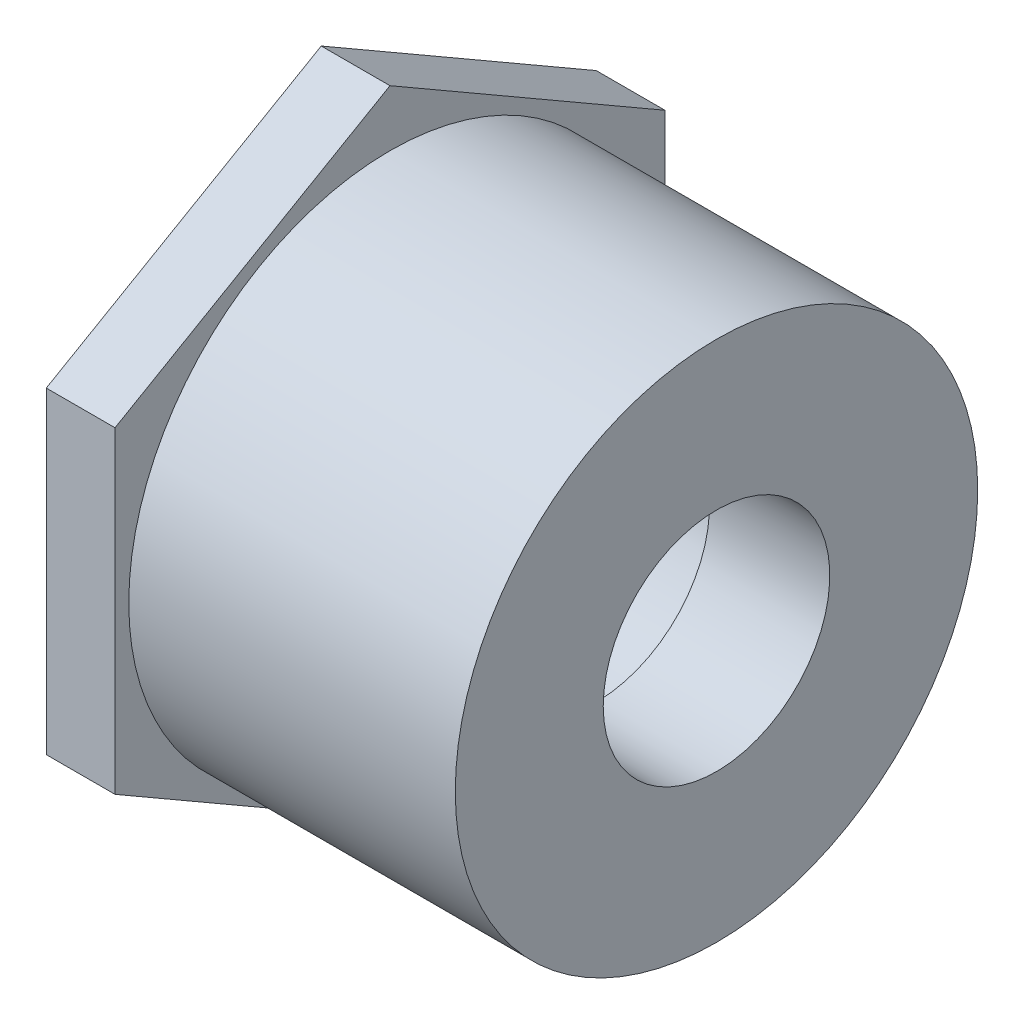
ISO-10303-21;
HEADER;
FILE_DESCRIPTION(('STEP AP214'),'2;1');
FILE_NAME('part.step','',(''),(''),'','','');
FILE_SCHEMA(('AUTOMOTIVE_DESIGN { 1 0 10303 214 1 1 1 1 }'));
ENDSEC;
DATA;
#1=APPLICATION_CONTEXT('core data for automotive mechanical design processes');
#2=APPLICATION_PROTOCOL_DEFINITION('international standard','automotive_design',2000,#1);
#3=PRODUCT_CONTEXT('',#1,'mechanical');
#4=PRODUCT('Part','Part','',(#3));
#5=PRODUCT_RELATED_PRODUCT_CATEGORY('part','',(#4));
#6=PRODUCT_DEFINITION_FORMATION('','',#4);
#7=PRODUCT_DEFINITION_CONTEXT('part definition',#1,'design');
#8=PRODUCT_DEFINITION('design','',#6,#7);
#9=PRODUCT_DEFINITION_SHAPE('','',#8);
#10=(LENGTH_UNIT() NAMED_UNIT(*) SI_UNIT(.MILLI.,.METRE.));
#11=(NAMED_UNIT(*) PLANE_ANGLE_UNIT() SI_UNIT($,.RADIAN.));
#12=(NAMED_UNIT(*) SI_UNIT($,.STERADIAN.) SOLID_ANGLE_UNIT());
#13=UNCERTAINTY_MEASURE_WITH_UNIT(LENGTH_MEASURE(1.E-05),#10,'distance_accuracy_value','');
#14=(GEOMETRIC_REPRESENTATION_CONTEXT(3) GLOBAL_UNCERTAINTY_ASSIGNED_CONTEXT((#13)) GLOBAL_UNIT_ASSIGNED_CONTEXT((#10,
#11,#12)) REPRESENTATION_CONTEXT('',''));
#15=CARTESIAN_POINT('',(0.,0.,0.));
#16=DIRECTION('',(0.,0.,1.));
#17=DIRECTION('',(1.,0.,0.));
#18=AXIS2_PLACEMENT_3D('',#15,#16,#17);
#19=CARTESIAN_POINT('',(-36.5125,0.,0.));
#20=DIRECTION('',(-1.,0.,0.));
#21=DIRECTION('',(0.,0.,1.));
#22=AXIS2_PLACEMENT_3D('',#19,#20,#21);
#23=CYLINDRICAL_SURFACE('',#22,24.13);
#24=CARTESIAN_POINT('',(0.,0.,0.));
#25=DIRECTION('',(-1.,0.,0.));
#26=DIRECTION('',(0.,0.,1.));
#27=AXIS2_PLACEMENT_3D('',#24,#25,#26);
#28=CIRCLE('',#27,24.13);
#29=CARTESIAN_POINT('',(0.,0.,24.13));
#30=VERTEX_POINT('',#29);
#31=EDGE_CURVE('E143',#30,#30,#28,.T.);
#32=ORIENTED_EDGE('',*,*,#31,.T.);
#33=EDGE_LOOP('',(#32));
#34=FACE_BOUND('',#33,.T.);
#35=CARTESIAN_POINT('',(-30.1625,0.,0.));
#36=DIRECTION('',(-1.,0.,0.));
#37=DIRECTION('',(0.,0.,1.));
#38=AXIS2_PLACEMENT_3D('',#35,#36,#37);
#39=CIRCLE('',#38,24.13);
#40=CARTESIAN_POINT('',(-30.1625,0.,24.13));
#41=VERTEX_POINT('',#40);
#42=EDGE_CURVE('E36',#41,#41,#39,.F.);
#43=ORIENTED_EDGE('',*,*,#42,.T.);
#44=EDGE_LOOP('',(#43));
#45=FACE_BOUND('',#44,.T.);
#46=ADVANCED_FACE('F32',(#34,#45),#23,.T.);
#47=CARTESIAN_POINT('',(-36.5125,-24.13,0.));
#48=DIRECTION('',(-1.,0.,0.));
#49=DIRECTION('',(0.,0.,1.));
#50=AXIS2_PLACEMENT_3D('',#47,#48,#49);
#51=PLANE('',#50);
#52=CARTESIAN_POINT('',(-36.5125,0.,0.));
#53=DIRECTION('',(-1.,0.,0.));
#54=DIRECTION('',(0.,0.,1.));
#55=AXIS2_PLACEMENT_3D('',#52,#53,#54);
#56=CIRCLE('',#55,13.4366);
#57=CARTESIAN_POINT('',(-36.5125,0.,13.4366));
#58=VERTEX_POINT('',#57);
#59=EDGE_CURVE('E11',#58,#58,#56,.T.);
#60=ORIENTED_EDGE('',*,*,#59,.F.);
#61=EDGE_LOOP('',(#60));
#62=FACE_BOUND('',#61,.T.);
#63=DIRECTION('',(0.,0.5,-0.866025403784439));
#64=VECTOR('',#63,1.);
#65=CARTESIAN_POINT('',(-36.5125,14.6646968374165,25.4));
#66=LINE('',#65,#64);
#67=CARTESIAN_POINT('',(-36.5125,14.6646968374165,25.4));
#68=VERTEX_POINT('',#67);
#69=CARTESIAN_POINT('',(-36.5125,29.329393674833,0.));
#70=VERTEX_POINT('',#69);
#71=EDGE_CURVE('E121',#68,#70,#66,.T.);
#72=ORIENTED_EDGE('',*,*,#71,.T.);
#73=DIRECTION('',(0.,-0.5,-0.866025403784439));
#74=VECTOR('',#73,1.);
#75=CARTESIAN_POINT('',(-36.5125,29.329393674833,0.));
#76=LINE('',#75,#74);
#77=CARTESIAN_POINT('',(-36.5125,14.6646968374165,-25.4));
#78=VERTEX_POINT('',#77);
#79=EDGE_CURVE('E124',#70,#78,#76,.T.);
#80=ORIENTED_EDGE('',*,*,#79,.T.);
#81=DIRECTION('',(0.,-1.,0.));
#82=VECTOR('',#81,1.);
#83=CARTESIAN_POINT('',(-36.5125,14.6646968374165,-25.4));
#84=LINE('',#83,#82);
#85=CARTESIAN_POINT('',(-36.5125,-14.6646968374165,-25.4));
#86=VERTEX_POINT('',#85);
#87=EDGE_CURVE('E127',#78,#86,#84,.T.);
#88=ORIENTED_EDGE('',*,*,#87,.T.);
#89=DIRECTION('',(0.,-0.5,0.866025403784439));
#90=VECTOR('',#89,1.);
#91=CARTESIAN_POINT('',(-36.5125,-14.6646968374165,-25.4));
#92=LINE('',#91,#90);
#93=CARTESIAN_POINT('',(-36.5125,-29.329393674833,0.));
#94=VERTEX_POINT('',#93);
#95=EDGE_CURVE('E130',#86,#94,#92,.T.);
#96=ORIENTED_EDGE('',*,*,#95,.T.);
#97=DIRECTION('',(0.,0.5,0.866025403784439));
#98=VECTOR('',#97,1.);
#99=CARTESIAN_POINT('',(-36.5125,-29.329393674833,0.));
#100=LINE('',#99,#98);
#101=CARTESIAN_POINT('',(-36.5125,-14.6646968374165,25.4));
#102=VERTEX_POINT('',#101);
#103=EDGE_CURVE('E98',#94,#102,#100,.T.);
#104=ORIENTED_EDGE('',*,*,#103,.T.);
#105=DIRECTION('',(0.,1.,0.));
#106=VECTOR('',#105,1.);
#107=CARTESIAN_POINT('',(-36.5125,-14.6646968374165,25.4));
#108=LINE('',#107,#106);
#109=EDGE_CURVE('E133',#102,#68,#108,.T.);
#110=ORIENTED_EDGE('',*,*,#109,.T.);
#111=EDGE_LOOP('',(#72,#80,#88,#96,#104,#110));
#112=FACE_BOUND('',#111,.T.);
#113=ADVANCED_FACE('F34',(#62,#112),#51,.T.);
#114=CARTESIAN_POINT('',(-11.1125,0.,0.));
#115=DIRECTION('',(-1.,0.,0.));
#116=DIRECTION('',(0.,0.,1.));
#117=AXIS2_PLACEMENT_3D('',#114,#115,#116);
#118=CONICAL_SURFACE('',#117,13.2842,0.00599992800155518);
#119=ORIENTED_EDGE('',*,*,#59,.T.);
#120=EDGE_LOOP('',(#119));
#121=FACE_BOUND('',#120,.T.);
#122=CARTESIAN_POINT('',(-11.1125,0.,0.));
#123=DIRECTION('',(-1.,0.,0.));
#124=DIRECTION('',(0.,0.,1.));
#125=AXIS2_PLACEMENT_3D('',#122,#123,#124);
#126=CIRCLE('',#125,13.2842);
#127=CARTESIAN_POINT('',(-11.1125,0.,13.2842));
#128=VERTEX_POINT('',#127);
#129=EDGE_CURVE('E42',#128,#128,#126,.T.);
#130=ORIENTED_EDGE('',*,*,#129,.F.);
#131=EDGE_LOOP('',(#130));
#132=FACE_BOUND('',#131,.T.);
#133=ADVANCED_FACE('F158',(#121,#132),#118,.F.);
#134=CARTESIAN_POINT('',(-11.1125,-10.4648,0.));
#135=DIRECTION('',(-1.,0.,0.));
#136=DIRECTION('',(0.,0.,1.));
#137=AXIS2_PLACEMENT_3D('',#134,#135,#136);
#138=PLANE('',#137);
#139=ORIENTED_EDGE('',*,*,#129,.T.);
#140=EDGE_LOOP('',(#139));
#141=FACE_BOUND('',#140,.T.);
#142=CARTESIAN_POINT('',(-11.1125,0.,0.));
#143=DIRECTION('',(-1.,0.,0.));
#144=DIRECTION('',(0.,0.,1.));
#145=AXIS2_PLACEMENT_3D('',#142,#143,#144);
#146=CIRCLE('',#145,10.4648);
#147=CARTESIAN_POINT('',(-11.1125,0.,10.4648));
#148=VERTEX_POINT('',#147);
#149=EDGE_CURVE('E149',#148,#148,#146,.T.);
#150=ORIENTED_EDGE('',*,*,#149,.F.);
#151=EDGE_LOOP('',(#150));
#152=FACE_BOUND('',#151,.T.);
#153=ADVANCED_FACE('F155',(#141,#152),#138,.T.);
#154=CARTESIAN_POINT('',(-36.5125,0.,0.));
#155=DIRECTION('',(-1.,0.,0.));
#156=DIRECTION('',(0.,0.,1.));
#157=AXIS2_PLACEMENT_3D('',#154,#155,#156);
#158=CYLINDRICAL_SURFACE('',#157,10.4648);
#159=ORIENTED_EDGE('',*,*,#149,.T.);
#160=EDGE_LOOP('',(#159));
#161=FACE_BOUND('',#160,.T.);
#162=CARTESIAN_POINT('',(0.,0.,0.));
#163=DIRECTION('',(-1.,0.,0.));
#164=DIRECTION('',(0.,0.,1.));
#165=AXIS2_PLACEMENT_3D('',#162,#163,#164);
#166=CIRCLE('',#165,10.4648);
#167=CARTESIAN_POINT('',(0.,0.,10.4648));
#168=VERTEX_POINT('',#167);
#169=EDGE_CURVE('E146',#168,#168,#166,.T.);
#170=ORIENTED_EDGE('',*,*,#169,.F.);
#171=EDGE_LOOP('',(#170));
#172=FACE_BOUND('',#171,.T.);
#173=ADVANCED_FACE('F165',(#161,#172),#158,.F.);
#174=CARTESIAN_POINT('',(0.,-10.4648,0.));
#175=DIRECTION('',(1.,0.,0.));
#176=DIRECTION('',(0.,0.,-1.));
#177=AXIS2_PLACEMENT_3D('',#174,#175,#176);
#178=PLANE('',#177);
#179=ORIENTED_EDGE('',*,*,#169,.T.);
#180=EDGE_LOOP('',(#179));
#181=FACE_BOUND('',#180,.T.);
#182=ORIENTED_EDGE('',*,*,#31,.F.);
#183=EDGE_LOOP('',(#182));
#184=FACE_BOUND('',#183,.T.);
#185=ADVANCED_FACE('F178',(#181,#184),#178,.T.);
#186=CARTESIAN_POINT('',(-30.1625,14.6646968374165,25.4));
#187=DIRECTION('',(0.,0.866025403784439,0.5));
#188=DIRECTION('',(0.,-0.5,0.866025403784439));
#189=AXIS2_PLACEMENT_3D('',#186,#187,#188);
#190=PLANE('',#189);
#191=ORIENTED_EDGE('',*,*,#71,.F.);
#192=DIRECTION('',(-1.,0.,0.));
#193=VECTOR('',#192,1.);
#194=CARTESIAN_POINT('',(-30.1625,14.6646968374165,25.4));
#195=LINE('',#194,#193);
#196=CARTESIAN_POINT('',(-30.1625,14.6646968374165,25.4));
#197=VERTEX_POINT('',#196);
#198=EDGE_CURVE('E50',#197,#68,#195,.T.);
#199=ORIENTED_EDGE('',*,*,#198,.F.);
#200=DIRECTION('',(0.,0.5,-0.866025403784439));
#201=VECTOR('',#200,1.);
#202=CARTESIAN_POINT('',(-30.1625,14.6646968374165,25.4));
#203=LINE('',#202,#201);
#204=CARTESIAN_POINT('',(-30.1625,29.329393674833,0.));
#205=VERTEX_POINT('',#204);
#206=EDGE_CURVE('E136',#197,#205,#203,.T.);
#207=ORIENTED_EDGE('',*,*,#206,.T.);
#208=DIRECTION('',(-1.,0.,0.));
#209=VECTOR('',#208,1.);
#210=CARTESIAN_POINT('',(-30.1625,29.329393674833,0.));
#211=LINE('',#210,#209);
#212=EDGE_CURVE('E85',#205,#70,#211,.T.);
#213=ORIENTED_EDGE('',*,*,#212,.T.);
#214=EDGE_LOOP('',(#191,#199,#207,#213));
#215=FACE_BOUND('',#214,.T.);
#216=ADVANCED_FACE('F176',(#215),#190,.T.);
#217=CARTESIAN_POINT('',(-30.1625,-14.6646968374165,25.4));
#218=DIRECTION('',(0.,0.,1.));
#219=DIRECTION('',(0.,-1.,0.));
#220=AXIS2_PLACEMENT_3D('',#217,#218,#219);
#221=PLANE('',#220);
#222=ORIENTED_EDGE('',*,*,#109,.F.);
#223=DIRECTION('',(-1.,0.,0.));
#224=VECTOR('',#223,1.);
#225=CARTESIAN_POINT('',(-30.1625,-14.6646968374165,25.4));
#226=LINE('',#225,#224);
#227=CARTESIAN_POINT('',(-30.1625,-14.6646968374165,25.4));
#228=VERTEX_POINT('',#227);
#229=EDGE_CURVE('E73',#228,#102,#226,.T.);
#230=ORIENTED_EDGE('',*,*,#229,.F.);
#231=DIRECTION('',(0.,1.,0.));
#232=VECTOR('',#231,1.);
#233=CARTESIAN_POINT('',(-30.1625,-14.6646968374165,25.4));
#234=LINE('',#233,#232);
#235=EDGE_CURVE('E111',#228,#197,#234,.T.);
#236=ORIENTED_EDGE('',*,*,#235,.T.);
#237=ORIENTED_EDGE('',*,*,#198,.T.);
#238=EDGE_LOOP('',(#222,#230,#236,#237));
#239=FACE_BOUND('',#238,.T.);
#240=ADVANCED_FACE('F203',(#239),#221,.T.);
#241=CARTESIAN_POINT('',(-30.1625,-29.329393674833,0.));
#242=DIRECTION('',(0.,-0.866025403784438,0.5));
#243=DIRECTION('',(0.,-0.5,-0.866025403784439));
#244=AXIS2_PLACEMENT_3D('',#241,#242,#243);
#245=PLANE('',#244);
#246=ORIENTED_EDGE('',*,*,#103,.F.);
#247=DIRECTION('',(-1.,0.,0.));
#248=VECTOR('',#247,1.);
#249=CARTESIAN_POINT('',(-30.1625,-29.329393674833,0.));
#250=LINE('',#249,#248);
#251=CARTESIAN_POINT('',(-30.1625,-29.329393674833,0.));
#252=VERTEX_POINT('',#251);
#253=EDGE_CURVE('E93',#252,#94,#250,.T.);
#254=ORIENTED_EDGE('',*,*,#253,.F.);
#255=DIRECTION('',(0.,0.5,0.866025403784439));
#256=VECTOR('',#255,1.);
#257=CARTESIAN_POINT('',(-30.1625,-29.329393674833,0.));
#258=LINE('',#257,#256);
#259=EDGE_CURVE('E96',#252,#228,#258,.T.);
#260=ORIENTED_EDGE('',*,*,#259,.T.);
#261=ORIENTED_EDGE('',*,*,#229,.T.);
#262=EDGE_LOOP('',(#246,#254,#260,#261));
#263=FACE_BOUND('',#262,.T.);
#264=ADVANCED_FACE('F95',(#263),#245,.T.);
#265=CARTESIAN_POINT('',(-30.1625,-14.6646968374165,-25.4));
#266=DIRECTION('',(0.,-0.866025403784439,-0.5));
#267=DIRECTION('',(0.,0.5,-0.866025403784439));
#268=AXIS2_PLACEMENT_3D('',#265,#266,#267);
#269=PLANE('',#268);
#270=ORIENTED_EDGE('',*,*,#95,.F.);
#271=DIRECTION('',(-1.,0.,0.));
#272=VECTOR('',#271,1.);
#273=CARTESIAN_POINT('',(-30.1625,-14.6646968374165,-25.4));
#274=LINE('',#273,#272);
#275=CARTESIAN_POINT('',(-30.1625,-14.6646968374165,-25.4));
#276=VERTEX_POINT('',#275);
#277=EDGE_CURVE('E103',#276,#86,#274,.T.);
#278=ORIENTED_EDGE('',*,*,#277,.F.);
#279=DIRECTION('',(0.,-0.5,0.866025403784439));
#280=VECTOR('',#279,1.);
#281=CARTESIAN_POINT('',(-30.1625,-14.6646968374165,-25.4));
#282=LINE('',#281,#280);
#283=EDGE_CURVE('E109',#276,#252,#282,.T.);
#284=ORIENTED_EDGE('',*,*,#283,.T.);
#285=ORIENTED_EDGE('',*,*,#253,.T.);
#286=EDGE_LOOP('',(#270,#278,#284,#285));
#287=FACE_BOUND('',#286,.T.);
#288=ADVANCED_FACE('F113',(#287),#269,.T.);
#289=CARTESIAN_POINT('',(-30.1625,14.6646968374165,-25.4));
#290=DIRECTION('',(0.,0.,-1.));
#291=DIRECTION('',(-1.,0.,0.));
#292=AXIS2_PLACEMENT_3D('',#289,#290,#291);
#293=PLANE('',#292);
#294=ORIENTED_EDGE('',*,*,#87,.F.);
#295=DIRECTION('',(-1.,0.,0.));
#296=VECTOR('',#295,1.);
#297=CARTESIAN_POINT('',(-30.1625,14.6646968374165,-25.4));
#298=LINE('',#297,#296);
#299=CARTESIAN_POINT('',(-30.1625,14.6646968374165,-25.4));
#300=VERTEX_POINT('',#299);
#301=EDGE_CURVE('E140',#300,#78,#298,.T.);
#302=ORIENTED_EDGE('',*,*,#301,.F.);
#303=DIRECTION('',(0.,-1.,0.));
#304=VECTOR('',#303,1.);
#305=CARTESIAN_POINT('',(-30.1625,14.6646968374165,-25.4));
#306=LINE('',#305,#304);
#307=EDGE_CURVE('E114',#300,#276,#306,.T.);
#308=ORIENTED_EDGE('',*,*,#307,.T.);
#309=ORIENTED_EDGE('',*,*,#277,.T.);
#310=EDGE_LOOP('',(#294,#302,#308,#309));
#311=FACE_BOUND('',#310,.T.);
#312=ADVANCED_FACE('F222',(#311),#293,.T.);
#313=CARTESIAN_POINT('',(-30.1625,29.329393674833,0.));
#314=DIRECTION('',(0.,0.866025403784439,-0.5));
#315=DIRECTION('',(0.,0.5,0.866025403784439));
#316=AXIS2_PLACEMENT_3D('',#313,#314,#315);
#317=PLANE('',#316);
#318=ORIENTED_EDGE('',*,*,#79,.F.);
#319=ORIENTED_EDGE('',*,*,#212,.F.);
#320=DIRECTION('',(0.,-0.5,-0.866025403784439));
#321=VECTOR('',#320,1.);
#322=CARTESIAN_POINT('',(-30.1625,29.329393674833,0.));
#323=LINE('',#322,#321);
#324=EDGE_CURVE('E116',#205,#300,#323,.T.);
#325=ORIENTED_EDGE('',*,*,#324,.T.);
#326=ORIENTED_EDGE('',*,*,#301,.T.);
#327=EDGE_LOOP('',(#318,#319,#325,#326));
#328=FACE_BOUND('',#327,.T.);
#329=ADVANCED_FACE('F229',(#328),#317,.T.);
#330=CARTESIAN_POINT('',(-30.1625,29.329393674833,0.));
#331=DIRECTION('',(-1.,0.,0.));
#332=DIRECTION('',(0.,0.,1.));
#333=AXIS2_PLACEMENT_3D('',#330,#331,#332);
#334=PLANE('',#333);
#335=ORIENTED_EDGE('',*,*,#42,.F.);
#336=EDGE_LOOP('',(#335));
#337=FACE_BOUND('',#336,.T.);
#338=ORIENTED_EDGE('',*,*,#206,.F.);
#339=ORIENTED_EDGE('',*,*,#235,.F.);
#340=ORIENTED_EDGE('',*,*,#259,.F.);
#341=ORIENTED_EDGE('',*,*,#283,.F.);
#342=ORIENTED_EDGE('',*,*,#307,.F.);
#343=ORIENTED_EDGE('',*,*,#324,.F.);
#344=EDGE_LOOP('',(#338,#339,#340,#341,#342,#343));
#345=FACE_BOUND('',#344,.T.);
#346=ADVANCED_FACE('F107',(#337,#345),#334,.F.);
#347=CLOSED_SHELL('',(#46,#113,#133,#153,#173,#185,#216,#240,#264,#288,#312,#329,#346));
#348=MANIFOLD_SOLID_BREP('B2',#347);
#349=ADVANCED_BREP_SHAPE_REPRESENTATION('',(#18,#348),#14);
#350=SHAPE_DEFINITION_REPRESENTATION(#9,#349);
ENDSEC;
END-ISO-10303-21;
